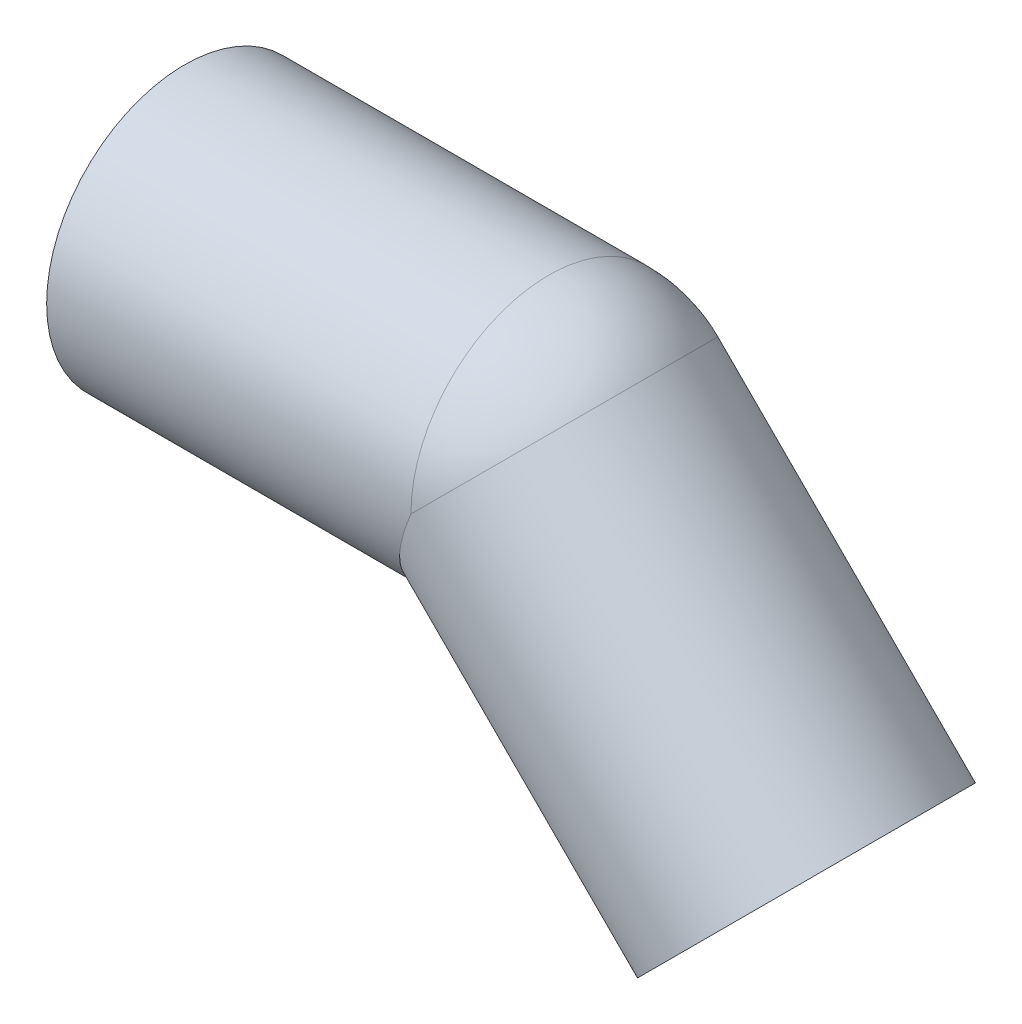
ISO-10303-21;
HEADER;
FILE_DESCRIPTION(('STEP AP214'),'2;1');
FILE_NAME('part.step','',(''),(''),'','','');
FILE_SCHEMA(('AUTOMOTIVE_DESIGN { 1 0 10303 214 1 1 1 1 }'));
ENDSEC;
DATA;
#1=APPLICATION_CONTEXT('core data for automotive mechanical design processes');
#2=APPLICATION_PROTOCOL_DEFINITION('international standard','automotive_design',2000,#1);
#3=PRODUCT_CONTEXT('',#1,'mechanical');
#4=PRODUCT('Part','Part','',(#3));
#5=PRODUCT_RELATED_PRODUCT_CATEGORY('part','',(#4));
#6=PRODUCT_DEFINITION_FORMATION('','',#4);
#7=PRODUCT_DEFINITION_CONTEXT('part definition',#1,'design');
#8=PRODUCT_DEFINITION('design','',#6,#7);
#9=PRODUCT_DEFINITION_SHAPE('','',#8);
#10=(LENGTH_UNIT() NAMED_UNIT(*) SI_UNIT(.MILLI.,.METRE.));
#11=(NAMED_UNIT(*) PLANE_ANGLE_UNIT() SI_UNIT($,.RADIAN.));
#12=(NAMED_UNIT(*) SI_UNIT($,.STERADIAN.) SOLID_ANGLE_UNIT());
#13=UNCERTAINTY_MEASURE_WITH_UNIT(LENGTH_MEASURE(1.E-05),#10,'distance_accuracy_value','');
#14=(GEOMETRIC_REPRESENTATION_CONTEXT(3) GLOBAL_UNCERTAINTY_ASSIGNED_CONTEXT((#13)) GLOBAL_UNIT_ASSIGNED_CONTEXT((#10,
#11,#12)) REPRESENTATION_CONTEXT('',''));
#15=CARTESIAN_POINT('',(0.,0.,0.));
#16=DIRECTION('',(0.,0.,1.));
#17=DIRECTION('',(1.,0.,0.));
#18=AXIS2_PLACEMENT_3D('',#15,#16,#17);
#19=CARTESIAN_POINT('',(112.669047558312,-46.669047558312,0.));
#20=DIRECTION('',(-0.707106781186549,0.707106781186546,0.));
#21=DIRECTION('',(-0.707106781186546,-0.707106781186549,0.));
#22=AXIS2_PLACEMENT_3D('',#19,#20,#21);
#23=CYLINDRICAL_SURFACE('',#22,22.);
#24=CARTESIAN_POINT('',(66.,0.,0.));
#25=DIRECTION('',(0.707106781186548,-0.707106781186547,0.));
#26=DIRECTION('',(0.,0.,-1.));
#27=AXIS2_PLACEMENT_3D('',#24,#25,#26);
#28=CIRCLE('',#27,22.);
#29=CARTESIAN_POINT('',(81.5563491869258,15.5563491852824,0.));
#30=VERTEX_POINT('',#29);
#31=CARTESIAN_POINT('',(65.9999999999998,0.,22.));
#32=VERTEX_POINT('',#31);
#33=EDGE_CURVE('E50',#30,#32,#28,.T.);
#34=ORIENTED_EDGE('',*,*,#33,.F.);
#35=CARTESIAN_POINT('',(66.,0.,0.));
#36=DIRECTION('',(0.707106781074499,-0.707106781298596,0.));
#37=DIRECTION('',(0.,0.,-1.));
#38=AXIS2_PLACEMENT_3D('',#35,#36,#37);
#39=CIRCLE('',#38,22.);
#40=CARTESIAN_POINT('',(65.9999999999999,0.,-22.));
#41=VERTEX_POINT('',#40);
#42=EDGE_CURVE('E43',#41,#30,#39,.T.);
#43=ORIENTED_EDGE('',*,*,#42,.F.);
#44=CARTESIAN_POINT('',(65.9999999999998,0.,0.));
#45=DIRECTION('',(-0.923879532511287,0.382683432365089,0.));
#46=DIRECTION('',(-0.382683432365088,-0.923879532511287,0.));
#47=AXIS2_PLACEMENT_3D('',#44,#45,#46);
#48=ELLIPSE('',#47,23.8126284064327,22.);
#49=EDGE_CURVE('E52',#32,#41,#48,.F.);
#50=ORIENTED_EDGE('',*,*,#49,.F.);
#51=EDGE_LOOP('',(#34,#43,#50));
#52=FACE_BOUND('',#51,.T.);
#53=CARTESIAN_POINT('',(112.669047558312,-46.6690475583121,0.));
#54=DIRECTION('',(-0.70710678118655,0.707106781186546,0.));
#55=DIRECTION('',(-0.707106781186546,-0.70710678118655,0.));
#56=AXIS2_PLACEMENT_3D('',#53,#54,#55);
#57=CIRCLE('',#56,22.);
#58=CARTESIAN_POINT('',(97.1126983722082,-62.2253967444162,0.));
#59=VERTEX_POINT('',#58);
#60=EDGE_CURVE('E18',#59,#59,#57,.T.);
#61=ORIENTED_EDGE('',*,*,#60,.F.);
#62=EDGE_LOOP('',(#61));
#63=FACE_BOUND('',#62,.T.);
#64=ADVANCED_FACE('F15',(#52,#63),#23,.F.);
#65=CARTESIAN_POINT('',(66.,0.,0.));
#66=DIRECTION('',(0.,0.,1.));
#67=DIRECTION('',(-1.,0.,0.));
#68=AXIS2_PLACEMENT_3D('',#65,#66,#67);
#69=SPHERICAL_SURFACE('',#68,22.);
#70=CARTESIAN_POINT('',(66.,0.,0.));
#71=DIRECTION('',(-1.,0.,0.));
#72=DIRECTION('',(0.,1.,0.));
#73=AXIS2_PLACEMENT_3D('',#70,#71,#72);
#74=CIRCLE('',#73,22.);
#75=EDGE_CURVE('E48',#41,#32,#74,.F.);
#76=ORIENTED_EDGE('',*,*,#75,.F.);
#77=ORIENTED_EDGE('',*,*,#42,.T.);
#78=ORIENTED_EDGE('',*,*,#33,.T.);
#79=EDGE_LOOP('',(#76,#77,#78));
#80=FACE_BOUND('',#79,.T.);
#81=ADVANCED_FACE('F55',(#80),#69,.F.);
#82=CARTESIAN_POINT('',(130.346717087979,-28.9913780286458,25.3000021083535));
#83=DIRECTION('',(0.707106781186547,-0.707106781186548,0.));
#84=DIRECTION('',(-0.707106781186548,-0.707106781186547,0.));
#85=AXIS2_PLACEMENT_3D('',#82,#83,#84);
#86=PLANE('',#85);
#87=ORIENTED_EDGE('',*,*,#60,.T.);
#88=EDGE_LOOP('',(#87));
#89=FACE_BOUND('',#88,.T.);
#90=CARTESIAN_POINT('',(112.669047558312,-46.6690475583121,0.));
#91=DIRECTION('',(-0.707106781186551,0.707106781186544,0.));
#92=DIRECTION('',(-0.707106781186544,-0.707106781186551,0.));
#93=AXIS2_PLACEMENT_3D('',#90,#91,#92);
#94=CIRCLE('',#93,25.);
#95=CARTESIAN_POINT('',(94.9913780286487,-64.3467170879759,0.));
#96=VERTEX_POINT('',#95);
#97=EDGE_CURVE('E68',#96,#96,#94,.T.);
#98=ORIENTED_EDGE('',*,*,#97,.F.);
#99=EDGE_LOOP('',(#98));
#100=FACE_BOUND('',#99,.T.);
#101=ADVANCED_FACE('F77',(#89,#100),#86,.T.);
#102=CARTESIAN_POINT('',(66.,0.,0.));
#103=DIRECTION('',(-1.,0.,0.));
#104=DIRECTION('',(0.,0.,1.));
#105=AXIS2_PLACEMENT_3D('',#102,#103,#104);
#106=CYLINDRICAL_SURFACE('',#105,22.);
#107=CARTESIAN_POINT('',(0.,0.,0.));
#108=DIRECTION('',(-1.,0.,0.));
#109=DIRECTION('',(0.,0.,1.));
#110=AXIS2_PLACEMENT_3D('',#107,#108,#109);
#111=CIRCLE('',#110,22.);
#112=CARTESIAN_POINT('',(0.,0.,22.));
#113=VERTEX_POINT('',#112);
#114=EDGE_CURVE('E65',#113,#113,#111,.F.);
#115=ORIENTED_EDGE('',*,*,#114,.F.);
#116=EDGE_LOOP('',(#115));
#117=FACE_BOUND('',#116,.T.);
#118=ORIENTED_EDGE('',*,*,#49,.T.);
#119=ORIENTED_EDGE('',*,*,#75,.T.);
#120=EDGE_LOOP('',(#118,#119));
#121=FACE_BOUND('',#120,.T.);
#122=ADVANCED_FACE('F80',(#117,#121),#106,.F.);
#123=CARTESIAN_POINT('',(66.,0.,0.));
#124=DIRECTION('',(0.,0.,1.));
#125=DIRECTION('',(1.,0.,0.));
#126=AXIS2_PLACEMENT_3D('',#123,#124,#125);
#127=SPHERICAL_SURFACE('',#126,25.);
#128=CARTESIAN_POINT('',(66.,0.,0.));
#129=DIRECTION('',(-1.,0.,0.));
#130=DIRECTION('',(0.,1.,0.));
#131=AXIS2_PLACEMENT_3D('',#128,#129,#130);
#132=CIRCLE('',#131,25.);
#133=CARTESIAN_POINT('',(65.9999999999998,1.01148193505769E-13,25.));
#134=VERTEX_POINT('',#133);
#135=CARTESIAN_POINT('',(65.9999999999998,0.,-25.));
#136=VERTEX_POINT('',#135);
#137=EDGE_CURVE('E64',#134,#136,#132,.T.);
#138=ORIENTED_EDGE('',*,*,#137,.F.);
#139=CARTESIAN_POINT('',(65.9999999999999,-1.2490009027033E-13,0.));
#140=DIRECTION('',(-0.707106781186551,0.707106781186544,0.));
#141=DIRECTION('',(0.707106781186544,0.707106781186551,0.));
#142=AXIS2_PLACEMENT_3D('',#139,#140,#141);
#143=CIRCLE('',#142,25.0000000000002);
#144=EDGE_CURVE('E32',#136,#134,#143,.F.);
#145=ORIENTED_EDGE('',*,*,#144,.F.);
#146=EDGE_LOOP('',(#138,#145));
#147=FACE_BOUND('',#146,.T.);
#148=ADVANCED_FACE('F84',(#147),#127,.T.);
#149=CARTESIAN_POINT('',(65.9999999999999,-1.11022302462516E-13,0.));
#150=DIRECTION('',(-0.707106781186551,0.707106781186544,0.));
#151=DIRECTION('',(-0.707106781186544,-0.707106781186551,0.));
#152=AXIS2_PLACEMENT_3D('',#149,#150,#151);
#153=CYLINDRICAL_SURFACE('',#152,25.);
#154=ORIENTED_EDGE('',*,*,#97,.T.);
#155=EDGE_LOOP('',(#154));
#156=FACE_BOUND('',#155,.T.);
#157=CARTESIAN_POINT('',(65.9999999999998,0.,0.));
#158=DIRECTION('',(-0.923879532511288,0.382683432365088,0.));
#159=DIRECTION('',(0.382683432365087,0.923879532511288,0.));
#160=AXIS2_PLACEMENT_3D('',#157,#158,#159);
#161=ELLIPSE('',#160,27.0598050073098,25.);
#162=EDGE_CURVE('E24',#136,#134,#161,.T.);
#163=ORIENTED_EDGE('',*,*,#162,.F.);
#164=ORIENTED_EDGE('',*,*,#144,.T.);
#165=EDGE_LOOP('',(#163,#164));
#166=FACE_BOUND('',#165,.T.);
#167=ADVANCED_FACE('F88',(#156,#166),#153,.T.);
#168=CARTESIAN_POINT('',(0.,-25.,25.3000021084363));
#169=DIRECTION('',(-1.,0.,0.));
#170=DIRECTION('',(0.,1.,0.));
#171=AXIS2_PLACEMENT_3D('',#168,#169,#170);
#172=PLANE('',#171);
#173=ORIENTED_EDGE('',*,*,#114,.T.);
#174=EDGE_LOOP('',(#173));
#175=FACE_BOUND('',#174,.T.);
#176=CARTESIAN_POINT('',(0.,0.,0.));
#177=DIRECTION('',(-1.,0.,0.));
#178=DIRECTION('',(0.,0.,1.));
#179=AXIS2_PLACEMENT_3D('',#176,#177,#178);
#180=CIRCLE('',#179,25.);
#181=CARTESIAN_POINT('',(0.,0.,25.));
#182=VERTEX_POINT('',#181);
#183=EDGE_CURVE('E9',#182,#182,#180,.F.);
#184=ORIENTED_EDGE('',*,*,#183,.F.);
#185=EDGE_LOOP('',(#184));
#186=FACE_BOUND('',#185,.T.);
#187=ADVANCED_FACE('F91',(#175,#186),#172,.T.);
#188=CARTESIAN_POINT('',(0.,0.,0.));
#189=DIRECTION('',(-1.,0.,0.));
#190=DIRECTION('',(0.,0.,1.));
#191=AXIS2_PLACEMENT_3D('',#188,#189,#190);
#192=CYLINDRICAL_SURFACE('',#191,25.);
#193=ORIENTED_EDGE('',*,*,#162,.T.);
#194=ORIENTED_EDGE('',*,*,#137,.T.);
#195=EDGE_LOOP('',(#193,#194));
#196=FACE_BOUND('',#195,.T.);
#197=ORIENTED_EDGE('',*,*,#183,.T.);
#198=EDGE_LOOP('',(#197));
#199=FACE_BOUND('',#198,.T.);
#200=ADVANCED_FACE('F95',(#196,#199),#192,.T.);
#201=CLOSED_SHELL('',(#64,#81,#101,#122,#148,#167,#187,#200));
#202=MANIFOLD_SOLID_BREP('B1',#201);
#203=ADVANCED_BREP_SHAPE_REPRESENTATION('',(#18,#202),#14);
#204=SHAPE_DEFINITION_REPRESENTATION(#9,#203);
ENDSEC;
END-ISO-10303-21;
